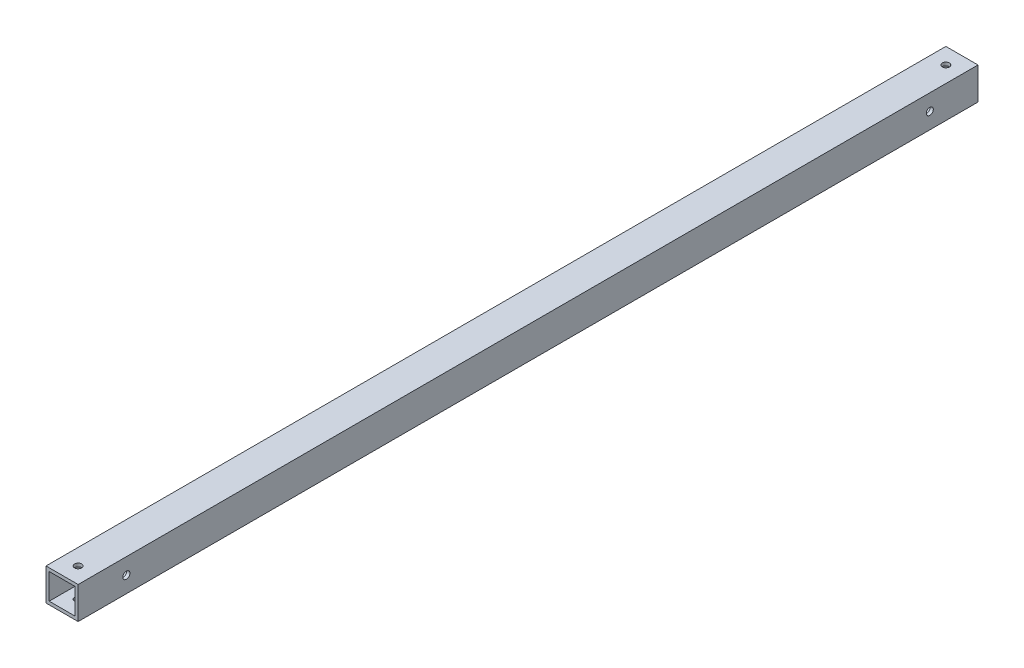
ISO-10303-21;
HEADER;
FILE_DESCRIPTION(('STEP AP214'),'2;1');
FILE_NAME('part.step','',(''),(''),'','','');
FILE_SCHEMA(('AUTOMOTIVE_DESIGN { 1 0 10303 214 1 1 1 1 }'));
ENDSEC;
DATA;
#1=APPLICATION_CONTEXT('core data for automotive mechanical design processes');
#2=APPLICATION_PROTOCOL_DEFINITION('international standard','automotive_design',2000,#1);
#3=PRODUCT_CONTEXT('',#1,'mechanical');
#4=PRODUCT('Part','Part','',(#3));
#5=PRODUCT_RELATED_PRODUCT_CATEGORY('part','',(#4));
#6=PRODUCT_DEFINITION_FORMATION('','',#4);
#7=PRODUCT_DEFINITION_CONTEXT('part definition',#1,'design');
#8=PRODUCT_DEFINITION('design','',#6,#7);
#9=PRODUCT_DEFINITION_SHAPE('','',#8);
#10=(LENGTH_UNIT() NAMED_UNIT(*) SI_UNIT(.MILLI.,.METRE.));
#11=(NAMED_UNIT(*) PLANE_ANGLE_UNIT() SI_UNIT($,.RADIAN.));
#12=(NAMED_UNIT(*) SI_UNIT($,.STERADIAN.) SOLID_ANGLE_UNIT());
#13=UNCERTAINTY_MEASURE_WITH_UNIT(LENGTH_MEASURE(1.E-05),#10,'distance_accuracy_value','');
#14=(GEOMETRIC_REPRESENTATION_CONTEXT(3) GLOBAL_UNCERTAINTY_ASSIGNED_CONTEXT((#13)) GLOBAL_UNIT_ASSIGNED_CONTEXT((#10,
#11,#12)) REPRESENTATION_CONTEXT('',''));
#15=CARTESIAN_POINT('',(0.,0.,0.));
#16=DIRECTION('',(0.,0.,1.));
#17=DIRECTION('',(1.,0.,0.));
#18=AXIS2_PLACEMENT_3D('',#15,#16,#17);
#19=CARTESIAN_POINT('',(0.,0.,560.));
#20=DIRECTION('',(0.,0.,1.));
#21=DIRECTION('',(1.,0.,0.));
#22=AXIS2_PLACEMENT_3D('',#19,#20,#21);
#23=PLANE('',#22);
#24=DIRECTION('',(0.,1.,0.));
#25=VECTOR('',#24,1.);
#26=CARTESIAN_POINT('',(10.,10.,560.));
#27=LINE('',#26,#25);
#28=CARTESIAN_POINT('',(10.,-10.,560.));
#29=VERTEX_POINT('',#28);
#30=CARTESIAN_POINT('',(10.,10.,560.));
#31=VERTEX_POINT('',#30);
#32=EDGE_CURVE('E157',#29,#31,#27,.T.);
#33=ORIENTED_EDGE('',*,*,#32,.T.);
#34=DIRECTION('',(-1.,0.,0.));
#35=VECTOR('',#34,1.);
#36=CARTESIAN_POINT('',(-10.,10.,560.));
#37=LINE('',#36,#35);
#38=CARTESIAN_POINT('',(-10.,10.,560.));
#39=VERTEX_POINT('',#38);
#40=EDGE_CURVE('E161',#31,#39,#37,.T.);
#41=ORIENTED_EDGE('',*,*,#40,.T.);
#42=DIRECTION('',(0.,-1.,0.));
#43=VECTOR('',#42,1.);
#44=CARTESIAN_POINT('',(-10.,10.,560.));
#45=LINE('',#44,#43);
#46=CARTESIAN_POINT('',(-10.,-10.,560.));
#47=VERTEX_POINT('',#46);
#48=EDGE_CURVE('E165',#39,#47,#45,.T.);
#49=ORIENTED_EDGE('',*,*,#48,.T.);
#50=DIRECTION('',(1.,0.,0.));
#51=VECTOR('',#50,1.);
#52=CARTESIAN_POINT('',(-10.,-10.,560.));
#53=LINE('',#52,#51);
#54=EDGE_CURVE('E168',#47,#29,#53,.T.);
#55=ORIENTED_EDGE('',*,*,#54,.T.);
#56=EDGE_LOOP('',(#33,#41,#49,#55));
#57=FACE_BOUND('',#56,.T.);
#58=DIRECTION('',(-1.,0.,0.));
#59=VECTOR('',#58,1.);
#60=CARTESIAN_POINT('',(-8.,8.,560.));
#61=LINE('',#60,#59);
#62=CARTESIAN_POINT('',(8.,8.,560.));
#63=VERTEX_POINT('',#62);
#64=CARTESIAN_POINT('',(-8.,8.,560.));
#65=VERTEX_POINT('',#64);
#66=EDGE_CURVE('E116',#63,#65,#61,.T.);
#67=ORIENTED_EDGE('',*,*,#66,.F.);
#68=DIRECTION('',(0.,1.,0.));
#69=VECTOR('',#68,1.);
#70=CARTESIAN_POINT('',(8.,8.,560.));
#71=LINE('',#70,#69);
#72=CARTESIAN_POINT('',(8.,-8.,560.));
#73=VERTEX_POINT('',#72);
#74=EDGE_CURVE('E107',#73,#63,#71,.T.);
#75=ORIENTED_EDGE('',*,*,#74,.F.);
#76=DIRECTION('',(1.,0.,0.));
#77=VECTOR('',#76,1.);
#78=CARTESIAN_POINT('',(-8.,-8.,560.));
#79=LINE('',#78,#77);
#80=CARTESIAN_POINT('',(-8.,-8.,560.));
#81=VERTEX_POINT('',#80);
#82=EDGE_CURVE('E133',#81,#73,#79,.T.);
#83=ORIENTED_EDGE('',*,*,#82,.F.);
#84=DIRECTION('',(0.,-1.,0.));
#85=VECTOR('',#84,1.);
#86=CARTESIAN_POINT('',(-8.,8.,560.));
#87=LINE('',#86,#85);
#88=EDGE_CURVE('E129',#65,#81,#87,.T.);
#89=ORIENTED_EDGE('',*,*,#88,.F.);
#90=EDGE_LOOP('',(#67,#75,#83,#89));
#91=FACE_BOUND('',#90,.T.);
#92=ADVANCED_FACE('F39',(#57,#91),#23,.T.);
#93=CARTESIAN_POINT('',(0.,0.,0.));
#94=DIRECTION('',(0.,0.,1.));
#95=DIRECTION('',(1.,0.,0.));
#96=AXIS2_PLACEMENT_3D('',#93,#94,#95);
#97=PLANE('',#96);
#98=DIRECTION('',(0.,1.,0.));
#99=VECTOR('',#98,1.);
#100=CARTESIAN_POINT('',(10.,10.,0.));
#101=LINE('',#100,#99);
#102=CARTESIAN_POINT('',(10.,-10.,0.));
#103=VERTEX_POINT('',#102);
#104=CARTESIAN_POINT('',(10.,10.,0.));
#105=VERTEX_POINT('',#104);
#106=EDGE_CURVE('E125',#103,#105,#101,.T.);
#107=ORIENTED_EDGE('',*,*,#106,.F.);
#108=DIRECTION('',(1.,0.,0.));
#109=VECTOR('',#108,1.);
#110=CARTESIAN_POINT('',(-10.,-10.,0.));
#111=LINE('',#110,#109);
#112=CARTESIAN_POINT('',(-10.,-10.,0.));
#113=VERTEX_POINT('',#112);
#114=EDGE_CURVE('E162',#113,#103,#111,.T.);
#115=ORIENTED_EDGE('',*,*,#114,.F.);
#116=DIRECTION('',(0.,-1.,0.));
#117=VECTOR('',#116,1.);
#118=CARTESIAN_POINT('',(-10.,10.,0.));
#119=LINE('',#118,#117);
#120=CARTESIAN_POINT('',(-10.,10.,0.));
#121=VERTEX_POINT('',#120);
#122=EDGE_CURVE('E178',#121,#113,#119,.T.);
#123=ORIENTED_EDGE('',*,*,#122,.F.);
#124=DIRECTION('',(-1.,0.,0.));
#125=VECTOR('',#124,1.);
#126=CARTESIAN_POINT('',(-10.,10.,0.));
#127=LINE('',#126,#125);
#128=EDGE_CURVE('E175',#105,#121,#127,.T.);
#129=ORIENTED_EDGE('',*,*,#128,.F.);
#130=EDGE_LOOP('',(#107,#115,#123,#129));
#131=FACE_BOUND('',#130,.T.);
#132=DIRECTION('',(0.,1.,0.));
#133=VECTOR('',#132,1.);
#134=CARTESIAN_POINT('',(8.,8.,0.));
#135=LINE('',#134,#133);
#136=CARTESIAN_POINT('',(8.,-8.,0.));
#137=VERTEX_POINT('',#136);
#138=CARTESIAN_POINT('',(8.,8.,0.));
#139=VERTEX_POINT('',#138);
#140=EDGE_CURVE('E65',#137,#139,#135,.T.);
#141=ORIENTED_EDGE('',*,*,#140,.T.);
#142=DIRECTION('',(-1.,0.,0.));
#143=VECTOR('',#142,1.);
#144=CARTESIAN_POINT('',(-8.,8.,0.));
#145=LINE('',#144,#143);
#146=CARTESIAN_POINT('',(-8.,8.,0.));
#147=VERTEX_POINT('',#146);
#148=EDGE_CURVE('E123',#139,#147,#145,.T.);
#149=ORIENTED_EDGE('',*,*,#148,.T.);
#150=DIRECTION('',(0.,-1.,0.));
#151=VECTOR('',#150,1.);
#152=CARTESIAN_POINT('',(-8.,8.,0.));
#153=LINE('',#152,#151);
#154=CARTESIAN_POINT('',(-8.,-8.,0.));
#155=VERTEX_POINT('',#154);
#156=EDGE_CURVE('E144',#147,#155,#153,.T.);
#157=ORIENTED_EDGE('',*,*,#156,.T.);
#158=DIRECTION('',(1.,0.,0.));
#159=VECTOR('',#158,1.);
#160=CARTESIAN_POINT('',(-8.,-8.,0.));
#161=LINE('',#160,#159);
#162=EDGE_CURVE('E117',#155,#137,#161,.T.);
#163=ORIENTED_EDGE('',*,*,#162,.T.);
#164=EDGE_LOOP('',(#141,#149,#157,#163));
#165=FACE_BOUND('',#164,.T.);
#166=ADVANCED_FACE('F278',(#131,#165),#97,.F.);
#167=CARTESIAN_POINT('',(10.,10.,560.));
#168=DIRECTION('',(-1.,0.,0.));
#169=DIRECTION('',(0.,0.,1.));
#170=AXIS2_PLACEMENT_3D('',#167,#168,#169);
#171=PLANE('',#170);
#172=CARTESIAN_POINT('',(10.,0.,30.));
#173=DIRECTION('',(1.,0.,0.));
#174=DIRECTION('',(0.,0.,-1.));
#175=AXIS2_PLACEMENT_3D('',#172,#173,#174);
#176=CIRCLE('',#175,2.2);
#177=CARTESIAN_POINT('',(10.,0.,27.8));
#178=VERTEX_POINT('',#177);
#179=EDGE_CURVE('E198',#178,#178,#176,.T.);
#180=ORIENTED_EDGE('',*,*,#179,.F.);
#181=EDGE_LOOP('',(#180));
#182=FACE_BOUND('',#181,.T.);
#183=CARTESIAN_POINT('',(10.,0.,530.));
#184=DIRECTION('',(1.,0.,0.));
#185=DIRECTION('',(0.,0.,-1.));
#186=AXIS2_PLACEMENT_3D('',#183,#184,#185);
#187=CIRCLE('',#186,2.19999999999998);
#188=CARTESIAN_POINT('',(10.,0.,527.8));
#189=VERTEX_POINT('',#188);
#190=EDGE_CURVE('E236',#189,#189,#187,.T.);
#191=ORIENTED_EDGE('',*,*,#190,.F.);
#192=EDGE_LOOP('',(#191));
#193=FACE_BOUND('',#192,.T.);
#194=ORIENTED_EDGE('',*,*,#106,.T.);
#195=DIRECTION('',(0.,0.,-1.));
#196=VECTOR('',#195,1.);
#197=CARTESIAN_POINT('',(10.,10.,560.));
#198=LINE('',#197,#196);
#199=EDGE_CURVE('E11',#31,#105,#198,.T.);
#200=ORIENTED_EDGE('',*,*,#199,.F.);
#201=ORIENTED_EDGE('',*,*,#32,.F.);
#202=DIRECTION('',(0.,0.,-1.));
#203=VECTOR('',#202,1.);
#204=CARTESIAN_POINT('',(10.,-10.,560.));
#205=LINE('',#204,#203);
#206=EDGE_CURVE('E171',#29,#103,#205,.T.);
#207=ORIENTED_EDGE('',*,*,#206,.T.);
#208=EDGE_LOOP('',(#194,#200,#201,#207));
#209=FACE_BOUND('',#208,.T.);
#210=ADVANCED_FACE('F41',(#182,#193,#209),#171,.F.);
#211=CARTESIAN_POINT('',(-10.,10.,560.));
#212=DIRECTION('',(0.,-1.,0.));
#213=DIRECTION('',(1.,0.,0.));
#214=AXIS2_PLACEMENT_3D('',#211,#212,#213);
#215=PLANE('',#214);
#216=CARTESIAN_POINT('',(0.,10.,10.));
#217=DIRECTION('',(0.,1.,0.));
#218=DIRECTION('',(-1.,0.,0.));
#219=AXIS2_PLACEMENT_3D('',#216,#217,#218);
#220=CIRCLE('',#219,2.2);
#221=CARTESIAN_POINT('',(-2.2,10.,10.));
#222=VERTEX_POINT('',#221);
#223=EDGE_CURVE('E208',#222,#222,#220,.T.);
#224=ORIENTED_EDGE('',*,*,#223,.F.);
#225=EDGE_LOOP('',(#224));
#226=FACE_BOUND('',#225,.T.);
#227=CARTESIAN_POINT('',(0.,10.,550.));
#228=DIRECTION('',(0.,1.,0.));
#229=DIRECTION('',(-1.,0.,0.));
#230=AXIS2_PLACEMENT_3D('',#227,#228,#229);
#231=CIRCLE('',#230,2.19999999999999);
#232=CARTESIAN_POINT('',(-2.19999999999999,10.,550.));
#233=VERTEX_POINT('',#232);
#234=EDGE_CURVE('E217',#233,#233,#231,.T.);
#235=ORIENTED_EDGE('',*,*,#234,.F.);
#236=EDGE_LOOP('',(#235));
#237=FACE_BOUND('',#236,.T.);
#238=ORIENTED_EDGE('',*,*,#128,.T.);
#239=DIRECTION('',(0.,0.,-1.));
#240=VECTOR('',#239,1.);
#241=CARTESIAN_POINT('',(-10.,10.,560.));
#242=LINE('',#241,#240);
#243=EDGE_CURVE('E49',#39,#121,#242,.T.);
#244=ORIENTED_EDGE('',*,*,#243,.F.);
#245=ORIENTED_EDGE('',*,*,#40,.F.);
#246=ORIENTED_EDGE('',*,*,#199,.T.);
#247=EDGE_LOOP('',(#238,#244,#245,#246));
#248=FACE_BOUND('',#247,.T.);
#249=ADVANCED_FACE('F294',(#226,#237,#248),#215,.F.);
#250=CARTESIAN_POINT('',(-10.,10.,560.));
#251=DIRECTION('',(1.,0.,0.));
#252=DIRECTION('',(0.,1.,0.));
#253=AXIS2_PLACEMENT_3D('',#250,#251,#252);
#254=PLANE('',#253);
#255=CARTESIAN_POINT('',(-10.,0.,30.));
#256=DIRECTION('',(1.,0.,0.));
#257=DIRECTION('',(0.,1.,0.));
#258=AXIS2_PLACEMENT_3D('',#255,#256,#257);
#259=CIRCLE('',#258,2.2);
#260=CARTESIAN_POINT('',(-10.,2.2,30.));
#261=VERTEX_POINT('',#260);
#262=EDGE_CURVE('E141',#261,#261,#259,.T.);
#263=ORIENTED_EDGE('',*,*,#262,.T.);
#264=EDGE_LOOP('',(#263));
#265=FACE_BOUND('',#264,.T.);
#266=CARTESIAN_POINT('',(-10.,0.,530.));
#267=DIRECTION('',(1.,0.,0.));
#268=DIRECTION('',(0.,1.,0.));
#269=AXIS2_PLACEMENT_3D('',#266,#267,#268);
#270=CIRCLE('',#269,2.19999999999998);
#271=CARTESIAN_POINT('',(-10.,2.19999999999998,530.));
#272=VERTEX_POINT('',#271);
#273=EDGE_CURVE('E203',#272,#272,#270,.T.);
#274=ORIENTED_EDGE('',*,*,#273,.T.);
#275=EDGE_LOOP('',(#274));
#276=FACE_BOUND('',#275,.T.);
#277=ORIENTED_EDGE('',*,*,#122,.T.);
#278=DIRECTION('',(0.,0.,-1.));
#279=VECTOR('',#278,1.);
#280=CARTESIAN_POINT('',(-10.,-10.,560.));
#281=LINE('',#280,#279);
#282=EDGE_CURVE('E186',#47,#113,#281,.T.);
#283=ORIENTED_EDGE('',*,*,#282,.F.);
#284=ORIENTED_EDGE('',*,*,#48,.F.);
#285=ORIENTED_EDGE('',*,*,#243,.T.);
#286=EDGE_LOOP('',(#277,#283,#284,#285));
#287=FACE_BOUND('',#286,.T.);
#288=ADVANCED_FACE('F255',(#265,#276,#287),#254,.F.);
#289=CARTESIAN_POINT('',(-10.,-10.,560.));
#290=DIRECTION('',(0.,1.,0.));
#291=DIRECTION('',(0.,0.,1.));
#292=AXIS2_PLACEMENT_3D('',#289,#290,#291);
#293=PLANE('',#292);
#294=CARTESIAN_POINT('',(0.,-10.,10.));
#295=DIRECTION('',(0.,1.,0.));
#296=DIRECTION('',(0.,0.,1.));
#297=AXIS2_PLACEMENT_3D('',#294,#295,#296);
#298=CIRCLE('',#297,2.2);
#299=CARTESIAN_POINT('',(0.,-10.,12.2));
#300=VERTEX_POINT('',#299);
#301=EDGE_CURVE('E232',#300,#300,#298,.T.);
#302=ORIENTED_EDGE('',*,*,#301,.T.);
#303=EDGE_LOOP('',(#302));
#304=FACE_BOUND('',#303,.T.);
#305=CARTESIAN_POINT('',(0.,-10.,550.));
#306=DIRECTION('',(0.,1.,0.));
#307=DIRECTION('',(0.,0.,1.));
#308=AXIS2_PLACEMENT_3D('',#305,#306,#307);
#309=CIRCLE('',#308,2.19999999999999);
#310=CARTESIAN_POINT('',(0.,-10.,552.2));
#311=VERTEX_POINT('',#310);
#312=EDGE_CURVE('E214',#311,#311,#309,.T.);
#313=ORIENTED_EDGE('',*,*,#312,.T.);
#314=EDGE_LOOP('',(#313));
#315=FACE_BOUND('',#314,.T.);
#316=ORIENTED_EDGE('',*,*,#114,.T.);
#317=ORIENTED_EDGE('',*,*,#206,.F.);
#318=ORIENTED_EDGE('',*,*,#54,.F.);
#319=ORIENTED_EDGE('',*,*,#282,.T.);
#320=EDGE_LOOP('',(#316,#317,#318,#319));
#321=FACE_BOUND('',#320,.T.);
#322=ADVANCED_FACE('F289',(#304,#315,#321),#293,.F.);
#323=CARTESIAN_POINT('',(8.,8.,560.));
#324=DIRECTION('',(-1.,0.,0.));
#325=DIRECTION('',(0.,0.,1.));
#326=AXIS2_PLACEMENT_3D('',#323,#324,#325);
#327=PLANE('',#326);
#328=CARTESIAN_POINT('',(8.00000000000001,0.,30.));
#329=DIRECTION('',(-1.,0.,0.));
#330=DIRECTION('',(0.,0.,1.));
#331=AXIS2_PLACEMENT_3D('',#328,#329,#330);
#332=CIRCLE('',#331,2.2);
#333=CARTESIAN_POINT('',(8.00000000000001,0.,32.2));
#334=VERTEX_POINT('',#333);
#335=EDGE_CURVE('E202',#334,#334,#332,.T.);
#336=ORIENTED_EDGE('',*,*,#335,.F.);
#337=EDGE_LOOP('',(#336));
#338=FACE_BOUND('',#337,.T.);
#339=CARTESIAN_POINT('',(8.00000000000001,0.,530.));
#340=DIRECTION('',(-1.,0.,0.));
#341=DIRECTION('',(0.,0.,1.));
#342=AXIS2_PLACEMENT_3D('',#339,#340,#341);
#343=CIRCLE('',#342,2.19999999999998);
#344=CARTESIAN_POINT('',(8.00000000000001,0.,532.2));
#345=VERTEX_POINT('',#344);
#346=EDGE_CURVE('E197',#345,#345,#343,.T.);
#347=ORIENTED_EDGE('',*,*,#346,.F.);
#348=EDGE_LOOP('',(#347));
#349=FACE_BOUND('',#348,.T.);
#350=ORIENTED_EDGE('',*,*,#140,.F.);
#351=DIRECTION('',(0.,0.,-1.));
#352=VECTOR('',#351,1.);
#353=CARTESIAN_POINT('',(8.,-8.,560.));
#354=LINE('',#353,#352);
#355=EDGE_CURVE('E111',#73,#137,#354,.T.);
#356=ORIENTED_EDGE('',*,*,#355,.F.);
#357=ORIENTED_EDGE('',*,*,#74,.T.);
#358=DIRECTION('',(0.,0.,-1.));
#359=VECTOR('',#358,1.);
#360=CARTESIAN_POINT('',(8.,8.,560.));
#361=LINE('',#360,#359);
#362=EDGE_CURVE('E110',#63,#139,#361,.T.);
#363=ORIENTED_EDGE('',*,*,#362,.T.);
#364=EDGE_LOOP('',(#350,#356,#357,#363));
#365=FACE_BOUND('',#364,.T.);
#366=ADVANCED_FACE('F109',(#338,#349,#365),#327,.T.);
#367=CARTESIAN_POINT('',(-8.,8.,560.));
#368=DIRECTION('',(0.,-1.,0.));
#369=DIRECTION('',(0.,0.,-1.));
#370=AXIS2_PLACEMENT_3D('',#367,#368,#369);
#371=PLANE('',#370);
#372=CARTESIAN_POINT('',(0.,8.00000000000001,10.));
#373=DIRECTION('',(0.,-1.,0.));
#374=DIRECTION('',(0.,0.,-1.));
#375=AXIS2_PLACEMENT_3D('',#372,#373,#374);
#376=CIRCLE('',#375,2.2);
#377=CARTESIAN_POINT('',(0.,8.00000000000001,7.80000000000001));
#378=VERTEX_POINT('',#377);
#379=EDGE_CURVE('E228',#378,#378,#376,.T.);
#380=ORIENTED_EDGE('',*,*,#379,.F.);
#381=EDGE_LOOP('',(#380));
#382=FACE_BOUND('',#381,.T.);
#383=CARTESIAN_POINT('',(0.,8.00000000000001,550.));
#384=DIRECTION('',(0.,-1.,0.));
#385=DIRECTION('',(0.,0.,-1.));
#386=AXIS2_PLACEMENT_3D('',#383,#384,#385);
#387=CIRCLE('',#386,2.19999999999999);
#388=CARTESIAN_POINT('',(0.,8.00000000000001,547.8));
#389=VERTEX_POINT('',#388);
#390=EDGE_CURVE('E207',#389,#389,#387,.T.);
#391=ORIENTED_EDGE('',*,*,#390,.F.);
#392=EDGE_LOOP('',(#391));
#393=FACE_BOUND('',#392,.T.);
#394=ORIENTED_EDGE('',*,*,#148,.F.);
#395=ORIENTED_EDGE('',*,*,#362,.F.);
#396=ORIENTED_EDGE('',*,*,#66,.T.);
#397=DIRECTION('',(0.,0.,-1.));
#398=VECTOR('',#397,1.);
#399=CARTESIAN_POINT('',(-8.,8.,560.));
#400=LINE('',#399,#398);
#401=EDGE_CURVE('E126',#65,#147,#400,.T.);
#402=ORIENTED_EDGE('',*,*,#401,.T.);
#403=EDGE_LOOP('',(#394,#395,#396,#402));
#404=FACE_BOUND('',#403,.T.);
#405=ADVANCED_FACE('F120',(#382,#393,#404),#371,.T.);
#406=CARTESIAN_POINT('',(-8.,8.,560.));
#407=DIRECTION('',(1.,0.,0.));
#408=DIRECTION('',(0.,0.,-1.));
#409=AXIS2_PLACEMENT_3D('',#406,#407,#408);
#410=PLANE('',#409);
#411=CARTESIAN_POINT('',(-8.00000000000001,0.,30.));
#412=DIRECTION('',(1.,0.,0.));
#413=DIRECTION('',(0.,0.,-1.));
#414=AXIS2_PLACEMENT_3D('',#411,#412,#413);
#415=CIRCLE('',#414,2.2);
#416=CARTESIAN_POINT('',(-8.00000000000001,0.,27.8));
#417=VERTEX_POINT('',#416);
#418=EDGE_CURVE('E199',#417,#417,#415,.T.);
#419=ORIENTED_EDGE('',*,*,#418,.F.);
#420=EDGE_LOOP('',(#419));
#421=FACE_BOUND('',#420,.T.);
#422=CARTESIAN_POINT('',(-8.00000000000001,0.,530.));
#423=DIRECTION('',(1.,0.,0.));
#424=DIRECTION('',(0.,0.,-1.));
#425=AXIS2_PLACEMENT_3D('',#422,#423,#424);
#426=CIRCLE('',#425,2.19999999999998);
#427=CARTESIAN_POINT('',(-8.00000000000001,0.,527.8));
#428=VERTEX_POINT('',#427);
#429=EDGE_CURVE('E193',#428,#428,#426,.T.);
#430=ORIENTED_EDGE('',*,*,#429,.F.);
#431=EDGE_LOOP('',(#430));
#432=FACE_BOUND('',#431,.T.);
#433=ORIENTED_EDGE('',*,*,#156,.F.);
#434=ORIENTED_EDGE('',*,*,#401,.F.);
#435=ORIENTED_EDGE('',*,*,#88,.T.);
#436=DIRECTION('',(0.,0.,-1.));
#437=VECTOR('',#436,1.);
#438=CARTESIAN_POINT('',(-8.,-8.,560.));
#439=LINE('',#438,#437);
#440=EDGE_CURVE('E57',#81,#155,#439,.T.);
#441=ORIENTED_EDGE('',*,*,#440,.T.);
#442=EDGE_LOOP('',(#433,#434,#435,#441));
#443=FACE_BOUND('',#442,.T.);
#444=ADVANCED_FACE('F320',(#421,#432,#443),#410,.T.);
#445=CARTESIAN_POINT('',(-8.,-8.,560.));
#446=DIRECTION('',(0.,1.,0.));
#447=DIRECTION('',(0.,0.,1.));
#448=AXIS2_PLACEMENT_3D('',#445,#446,#447);
#449=PLANE('',#448);
#450=CARTESIAN_POINT('',(0.,-8.00000000000001,10.));
#451=DIRECTION('',(0.,1.,0.));
#452=DIRECTION('',(0.,0.,1.));
#453=AXIS2_PLACEMENT_3D('',#450,#451,#452);
#454=CIRCLE('',#453,2.2);
#455=CARTESIAN_POINT('',(0.,-8.00000000000001,12.2));
#456=VERTEX_POINT('',#455);
#457=EDGE_CURVE('E43',#456,#456,#454,.T.);
#458=ORIENTED_EDGE('',*,*,#457,.F.);
#459=EDGE_LOOP('',(#458));
#460=FACE_BOUND('',#459,.T.);
#461=CARTESIAN_POINT('',(0.,-8.00000000000001,550.));
#462=DIRECTION('',(0.,1.,0.));
#463=DIRECTION('',(0.,0.,1.));
#464=AXIS2_PLACEMENT_3D('',#461,#462,#463);
#465=CIRCLE('',#464,2.19999999999999);
#466=CARTESIAN_POINT('',(0.,-8.00000000000001,552.2));
#467=VERTEX_POINT('',#466);
#468=EDGE_CURVE('E204',#467,#467,#465,.T.);
#469=ORIENTED_EDGE('',*,*,#468,.F.);
#470=EDGE_LOOP('',(#469));
#471=FACE_BOUND('',#470,.T.);
#472=ORIENTED_EDGE('',*,*,#162,.F.);
#473=ORIENTED_EDGE('',*,*,#440,.F.);
#474=ORIENTED_EDGE('',*,*,#82,.T.);
#475=ORIENTED_EDGE('',*,*,#355,.T.);
#476=EDGE_LOOP('',(#472,#473,#474,#475));
#477=FACE_BOUND('',#476,.T.);
#478=ADVANCED_FACE('F271',(#460,#471,#477),#449,.T.);
#479=CARTESIAN_POINT('',(-550.,0.,530.));
#480=DIRECTION('',(1.,0.,0.));
#481=DIRECTION('',(0.,0.,-1.));
#482=AXIS2_PLACEMENT_3D('',#479,#480,#481);
#483=CYLINDRICAL_SURFACE('',#482,2.19999999999998);
#484=ORIENTED_EDGE('',*,*,#429,.T.);
#485=EDGE_LOOP('',(#484));
#486=FACE_BOUND('',#485,.T.);
#487=ORIENTED_EDGE('',*,*,#273,.F.);
#488=EDGE_LOOP('',(#487));
#489=FACE_BOUND('',#488,.T.);
#490=ADVANCED_FACE('F261',(#486,#489),#483,.F.);
#491=CARTESIAN_POINT('',(-550.,0.,30.));
#492=DIRECTION('',(1.,0.,0.));
#493=DIRECTION('',(0.,0.,-1.));
#494=AXIS2_PLACEMENT_3D('',#491,#492,#493);
#495=CYLINDRICAL_SURFACE('',#494,2.2);
#496=ORIENTED_EDGE('',*,*,#418,.T.);
#497=EDGE_LOOP('',(#496));
#498=FACE_BOUND('',#497,.T.);
#499=ORIENTED_EDGE('',*,*,#262,.F.);
#500=EDGE_LOOP('',(#499));
#501=FACE_BOUND('',#500,.T.);
#502=ADVANCED_FACE('F258',(#498,#501),#495,.F.);
#503=ORIENTED_EDGE('',*,*,#346,.T.);
#504=EDGE_LOOP('',(#503));
#505=FACE_BOUND('',#504,.T.);
#506=ORIENTED_EDGE('',*,*,#190,.T.);
#507=EDGE_LOOP('',(#506));
#508=FACE_BOUND('',#507,.T.);
#509=ADVANCED_FACE('F260',(#505,#508),#483,.F.);
#510=ORIENTED_EDGE('',*,*,#335,.T.);
#511=EDGE_LOOP('',(#510));
#512=FACE_BOUND('',#511,.T.);
#513=ORIENTED_EDGE('',*,*,#179,.T.);
#514=EDGE_LOOP('',(#513));
#515=FACE_BOUND('',#514,.T.);
#516=ADVANCED_FACE('F264',(#512,#515),#495,.F.);
#517=CARTESIAN_POINT('',(0.,-550.,550.));
#518=DIRECTION('',(0.,1.,0.));
#519=DIRECTION('',(-1.,0.,0.));
#520=AXIS2_PLACEMENT_3D('',#517,#518,#519);
#521=CYLINDRICAL_SURFACE('',#520,2.19999999999999);
#522=ORIENTED_EDGE('',*,*,#468,.T.);
#523=EDGE_LOOP('',(#522));
#524=FACE_BOUND('',#523,.T.);
#525=ORIENTED_EDGE('',*,*,#312,.F.);
#526=EDGE_LOOP('',(#525));
#527=FACE_BOUND('',#526,.T.);
#528=ADVANCED_FACE('F275',(#524,#527),#521,.F.);
#529=CARTESIAN_POINT('',(0.,-550.,10.));
#530=DIRECTION('',(0.,1.,0.));
#531=DIRECTION('',(-1.,0.,0.));
#532=AXIS2_PLACEMENT_3D('',#529,#530,#531);
#533=CYLINDRICAL_SURFACE('',#532,2.2);
#534=ORIENTED_EDGE('',*,*,#457,.T.);
#535=EDGE_LOOP('',(#534));
#536=FACE_BOUND('',#535,.T.);
#537=ORIENTED_EDGE('',*,*,#301,.F.);
#538=EDGE_LOOP('',(#537));
#539=FACE_BOUND('',#538,.T.);
#540=ADVANCED_FACE('F344',(#536,#539),#533,.F.);
#541=ORIENTED_EDGE('',*,*,#390,.T.);
#542=EDGE_LOOP('',(#541));
#543=FACE_BOUND('',#542,.T.);
#544=ORIENTED_EDGE('',*,*,#234,.T.);
#545=EDGE_LOOP('',(#544));
#546=FACE_BOUND('',#545,.T.);
#547=ADVANCED_FACE('F340',(#543,#546),#521,.F.);
#548=ORIENTED_EDGE('',*,*,#379,.T.);
#549=EDGE_LOOP('',(#548));
#550=FACE_BOUND('',#549,.T.);
#551=ORIENTED_EDGE('',*,*,#223,.T.);
#552=EDGE_LOOP('',(#551));
#553=FACE_BOUND('',#552,.T.);
#554=ADVANCED_FACE('F343',(#550,#553),#533,.F.);
#555=CLOSED_SHELL('',(#92,#166,#210,#249,#288,#322,#366,#405,#444,#478,#490,#502,#509,#516,#528,
#540,#547,#554));
#556=MANIFOLD_SOLID_BREP('B2',#555);
#557=ADVANCED_BREP_SHAPE_REPRESENTATION('',(#18,#556),#14);
#558=SHAPE_DEFINITION_REPRESENTATION(#9,#557);
ENDSEC;
END-ISO-10303-21;
